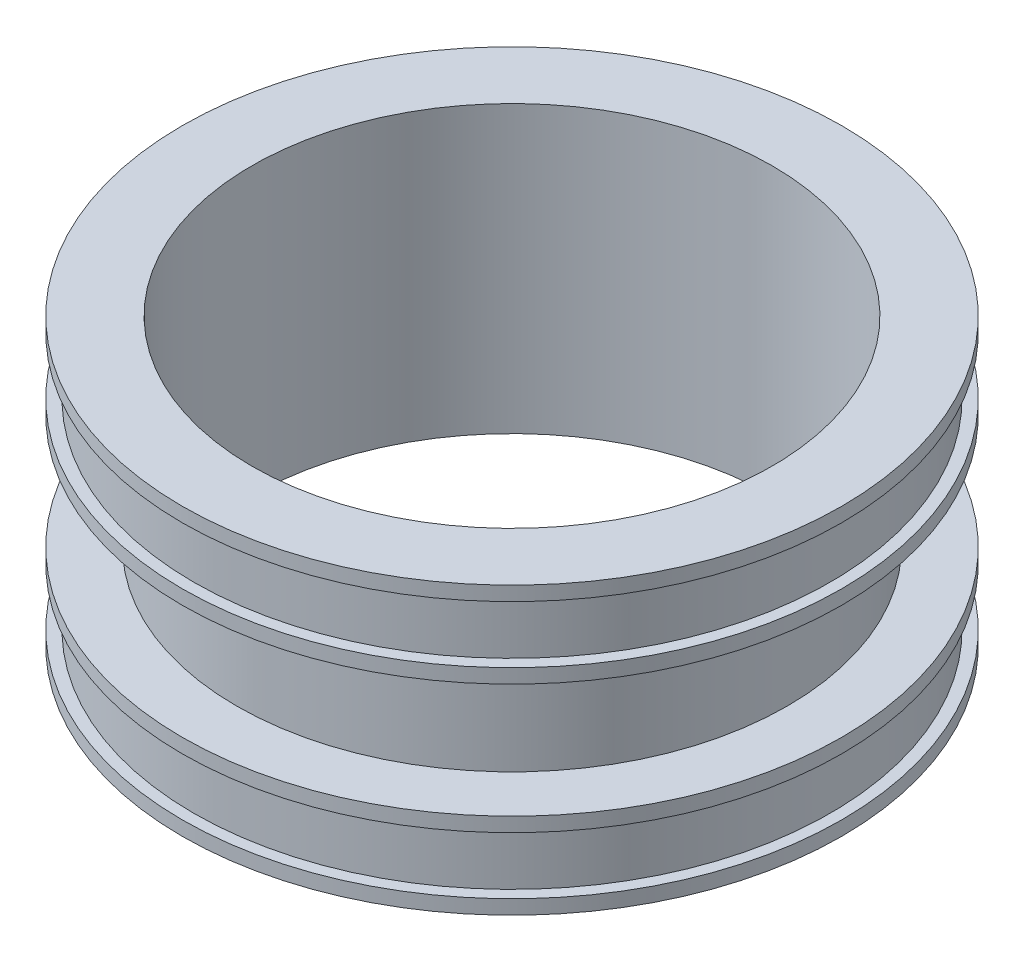
ISO-10303-21;
HEADER;
FILE_DESCRIPTION(('STEP AP214'),'2;1');
FILE_NAME('part.step','',(''),(''),'','','');
FILE_SCHEMA(('AUTOMOTIVE_DESIGN { 1 0 10303 214 1 1 1 1 }'));
ENDSEC;
DATA;
#1=APPLICATION_CONTEXT('core data for automotive mechanical design processes');
#2=APPLICATION_PROTOCOL_DEFINITION('international standard','automotive_design',2000,#1);
#3=PRODUCT_CONTEXT('',#1,'mechanical');
#4=PRODUCT('Part','Part','',(#3));
#5=PRODUCT_RELATED_PRODUCT_CATEGORY('part','',(#4));
#6=PRODUCT_DEFINITION_FORMATION('','',#4);
#7=PRODUCT_DEFINITION_CONTEXT('part definition',#1,'design');
#8=PRODUCT_DEFINITION('design','',#6,#7);
#9=PRODUCT_DEFINITION_SHAPE('','',#8);
#10=(LENGTH_UNIT() NAMED_UNIT(*) SI_UNIT(.MILLI.,.METRE.));
#11=(NAMED_UNIT(*) PLANE_ANGLE_UNIT() SI_UNIT($,.RADIAN.));
#12=(NAMED_UNIT(*) SI_UNIT($,.STERADIAN.) SOLID_ANGLE_UNIT());
#13=UNCERTAINTY_MEASURE_WITH_UNIT(LENGTH_MEASURE(1.E-05),#10,'distance_accuracy_value','');
#14=(GEOMETRIC_REPRESENTATION_CONTEXT(3) GLOBAL_UNCERTAINTY_ASSIGNED_CONTEXT((#13)) GLOBAL_UNIT_ASSIGNED_CONTEXT((#10,
#11,#12)) REPRESENTATION_CONTEXT('',''));
#15=CARTESIAN_POINT('',(0.,0.,0.));
#16=DIRECTION('',(0.,0.,1.));
#17=DIRECTION('',(1.,0.,0.));
#18=AXIS2_PLACEMENT_3D('',#15,#16,#17);
#19=CARTESIAN_POINT('',(0.,0.,0.));
#20=DIRECTION('',(0.,-1.,0.));
#21=DIRECTION('',(0.,0.,-1.));
#22=AXIS2_PLACEMENT_3D('',#19,#20,#21);
#23=CYLINDRICAL_SURFACE('',#22,136.525);
#24=CARTESIAN_POINT('',(0.,0.,0.));
#25=DIRECTION('',(0.,-1.,0.));
#26=DIRECTION('',(0.,0.,-1.));
#27=AXIS2_PLACEMENT_3D('',#24,#25,#26);
#28=CIRCLE('',#27,136.525);
#29=CARTESIAN_POINT('',(0.,0.,-136.525));
#30=VERTEX_POINT('',#29);
#31=EDGE_CURVE('E92',#30,#30,#28,.T.);
#32=ORIENTED_EDGE('',*,*,#31,.T.);
#33=EDGE_LOOP('',(#32));
#34=FACE_BOUND('',#33,.T.);
#35=CARTESIAN_POINT('',(0.,150.,0.));
#36=DIRECTION('',(0.,-1.,0.));
#37=DIRECTION('',(0.,0.,-1.));
#38=AXIS2_PLACEMENT_3D('',#35,#36,#37);
#39=CIRCLE('',#38,136.525);
#40=CARTESIAN_POINT('',(0.,150.,-136.525));
#41=VERTEX_POINT('',#40);
#42=EDGE_CURVE('E12',#41,#41,#39,.T.);
#43=ORIENTED_EDGE('',*,*,#42,.F.);
#44=EDGE_LOOP('',(#43));
#45=FACE_BOUND('',#44,.T.);
#46=ADVANCED_FACE('F40',(#34,#45),#23,.F.);
#47=CARTESIAN_POINT('',(136.525,150.,0.));
#48=DIRECTION('',(0.,1.,0.));
#49=DIRECTION('',(0.,0.,1.));
#50=AXIS2_PLACEMENT_3D('',#47,#48,#49);
#51=PLANE('',#50);
#52=ORIENTED_EDGE('',*,*,#42,.T.);
#53=EDGE_LOOP('',(#52));
#54=FACE_BOUND('',#53,.T.);
#55=CARTESIAN_POINT('',(0.,150.,0.));
#56=DIRECTION('',(0.,-1.,0.));
#57=DIRECTION('',(0.,0.,-1.));
#58=AXIS2_PLACEMENT_3D('',#55,#56,#57);
#59=CIRCLE('',#58,173.);
#60=CARTESIAN_POINT('',(0.,150.,-173.));
#61=VERTEX_POINT('',#60);
#62=EDGE_CURVE('E46',#61,#61,#59,.T.);
#63=ORIENTED_EDGE('',*,*,#62,.F.);
#64=EDGE_LOOP('',(#63));
#65=FACE_BOUND('',#64,.T.);
#66=ADVANCED_FACE('F110',(#54,#65),#51,.T.);
#67=CARTESIAN_POINT('',(0.,0.,0.));
#68=DIRECTION('',(0.,-1.,0.));
#69=DIRECTION('',(0.,0.,-1.));
#70=AXIS2_PLACEMENT_3D('',#67,#68,#69);
#71=CYLINDRICAL_SURFACE('',#70,173.);
#72=ORIENTED_EDGE('',*,*,#62,.T.);
#73=EDGE_LOOP('',(#72));
#74=FACE_BOUND('',#73,.T.);
#75=CARTESIAN_POINT('',(0.,142.5,0.));
#76=DIRECTION('',(0.,-1.,0.));
#77=DIRECTION('',(0.,0.,-1.));
#78=AXIS2_PLACEMENT_3D('',#75,#76,#77);
#79=CIRCLE('',#78,173.);
#80=CARTESIAN_POINT('',(0.,142.5,-173.));
#81=VERTEX_POINT('',#80);
#82=EDGE_CURVE('E50',#81,#81,#79,.T.);
#83=ORIENTED_EDGE('',*,*,#82,.F.);
#84=EDGE_LOOP('',(#83));
#85=FACE_BOUND('',#84,.T.);
#86=ADVANCED_FACE('F114',(#74,#85),#71,.T.);
#87=CARTESIAN_POINT('',(173.,142.5,0.));
#88=DIRECTION('',(0.,-1.,0.));
#89=DIRECTION('',(0.,0.,-1.));
#90=AXIS2_PLACEMENT_3D('',#87,#88,#89);
#91=PLANE('',#90);
#92=ORIENTED_EDGE('',*,*,#82,.T.);
#93=EDGE_LOOP('',(#92));
#94=FACE_BOUND('',#93,.T.);
#95=CARTESIAN_POINT('',(0.,142.5,0.));
#96=DIRECTION('',(0.,-1.,0.));
#97=DIRECTION('',(0.,0.,-1.));
#98=AXIS2_PLACEMENT_3D('',#95,#96,#97);
#99=CIRCLE('',#98,167.);
#100=CARTESIAN_POINT('',(0.,142.5,-167.));
#101=VERTEX_POINT('',#100);
#102=EDGE_CURVE('E54',#101,#101,#99,.T.);
#103=ORIENTED_EDGE('',*,*,#102,.F.);
#104=EDGE_LOOP('',(#103));
#105=FACE_BOUND('',#104,.T.);
#106=ADVANCED_FACE('F118',(#94,#105),#91,.T.);
#107=CARTESIAN_POINT('',(0.,0.,0.));
#108=DIRECTION('',(0.,-1.,0.));
#109=DIRECTION('',(0.,0.,-1.));
#110=AXIS2_PLACEMENT_3D('',#107,#108,#109);
#111=CYLINDRICAL_SURFACE('',#110,167.);
#112=ORIENTED_EDGE('',*,*,#102,.T.);
#113=EDGE_LOOP('',(#112));
#114=FACE_BOUND('',#113,.T.);
#115=CARTESIAN_POINT('',(0.,112.5,0.));
#116=DIRECTION('',(0.,-1.,0.));
#117=DIRECTION('',(0.,0.,-1.));
#118=AXIS2_PLACEMENT_3D('',#115,#116,#117);
#119=CIRCLE('',#118,167.);
#120=CARTESIAN_POINT('',(0.,112.5,-167.));
#121=VERTEX_POINT('',#120);
#122=EDGE_CURVE('E59',#121,#121,#119,.T.);
#123=ORIENTED_EDGE('',*,*,#122,.F.);
#124=EDGE_LOOP('',(#123));
#125=FACE_BOUND('',#124,.T.);
#126=ADVANCED_FACE('F124',(#114,#125),#111,.T.);
#127=CARTESIAN_POINT('',(167.,112.5,0.));
#128=DIRECTION('',(0.,1.,0.));
#129=DIRECTION('',(0.,0.,1.));
#130=AXIS2_PLACEMENT_3D('',#127,#128,#129);
#131=PLANE('',#130);
#132=ORIENTED_EDGE('',*,*,#122,.T.);
#133=EDGE_LOOP('',(#132));
#134=FACE_BOUND('',#133,.T.);
#135=CARTESIAN_POINT('',(0.,112.5,0.));
#136=DIRECTION('',(0.,-1.,0.));
#137=DIRECTION('',(0.,0.,-1.));
#138=AXIS2_PLACEMENT_3D('',#135,#136,#137);
#139=CIRCLE('',#138,173.);
#140=CARTESIAN_POINT('',(0.,112.5,-173.));
#141=VERTEX_POINT('',#140);
#142=EDGE_CURVE('E62',#141,#141,#139,.T.);
#143=ORIENTED_EDGE('',*,*,#142,.F.);
#144=EDGE_LOOP('',(#143));
#145=FACE_BOUND('',#144,.T.);
#146=ADVANCED_FACE('F128',(#134,#145),#131,.T.);
#147=CARTESIAN_POINT('',(0.,0.,0.));
#148=DIRECTION('',(0.,-1.,0.));
#149=DIRECTION('',(0.,0.,-1.));
#150=AXIS2_PLACEMENT_3D('',#147,#148,#149);
#151=CYLINDRICAL_SURFACE('',#150,173.);
#152=ORIENTED_EDGE('',*,*,#142,.T.);
#153=EDGE_LOOP('',(#152));
#154=FACE_BOUND('',#153,.T.);
#155=CARTESIAN_POINT('',(0.,105.,0.));
#156=DIRECTION('',(0.,-1.,0.));
#157=DIRECTION('',(0.,0.,-1.));
#158=AXIS2_PLACEMENT_3D('',#155,#156,#157);
#159=CIRCLE('',#158,173.);
#160=CARTESIAN_POINT('',(0.,105.,-173.));
#161=VERTEX_POINT('',#160);
#162=EDGE_CURVE('E65',#161,#161,#159,.T.);
#163=ORIENTED_EDGE('',*,*,#162,.F.);
#164=EDGE_LOOP('',(#163));
#165=FACE_BOUND('',#164,.T.);
#166=ADVANCED_FACE('F132',(#154,#165),#151,.T.);
#167=CARTESIAN_POINT('',(173.,105.,0.));
#168=DIRECTION('',(0.,-1.,0.));
#169=DIRECTION('',(0.,0.,-1.));
#170=AXIS2_PLACEMENT_3D('',#167,#168,#169);
#171=PLANE('',#170);
#172=ORIENTED_EDGE('',*,*,#162,.T.);
#173=EDGE_LOOP('',(#172));
#174=FACE_BOUND('',#173,.T.);
#175=CARTESIAN_POINT('',(0.,105.,0.));
#176=DIRECTION('',(0.,-1.,0.));
#177=DIRECTION('',(0.,0.,-1.));
#178=AXIS2_PLACEMENT_3D('',#175,#176,#177);
#179=CIRCLE('',#178,144.525);
#180=CARTESIAN_POINT('',(0.,105.,-144.525));
#181=VERTEX_POINT('',#180);
#182=EDGE_CURVE('E68',#181,#181,#179,.T.);
#183=ORIENTED_EDGE('',*,*,#182,.F.);
#184=EDGE_LOOP('',(#183));
#185=FACE_BOUND('',#184,.T.);
#186=ADVANCED_FACE('F136',(#174,#185),#171,.T.);
#187=CARTESIAN_POINT('',(0.,0.,0.));
#188=DIRECTION('',(0.,-1.,0.));
#189=DIRECTION('',(0.,0.,-1.));
#190=AXIS2_PLACEMENT_3D('',#187,#188,#189);
#191=CYLINDRICAL_SURFACE('',#190,144.525);
#192=ORIENTED_EDGE('',*,*,#182,.T.);
#193=EDGE_LOOP('',(#192));
#194=FACE_BOUND('',#193,.T.);
#195=CARTESIAN_POINT('',(0.,44.9999999999999,0.));
#196=DIRECTION('',(0.,-1.,0.));
#197=DIRECTION('',(0.,0.,-1.));
#198=AXIS2_PLACEMENT_3D('',#195,#196,#197);
#199=CIRCLE('',#198,144.525);
#200=CARTESIAN_POINT('',(0.,44.9999999999999,-144.525));
#201=VERTEX_POINT('',#200);
#202=EDGE_CURVE('E71',#201,#201,#199,.T.);
#203=ORIENTED_EDGE('',*,*,#202,.F.);
#204=EDGE_LOOP('',(#203));
#205=FACE_BOUND('',#204,.T.);
#206=ADVANCED_FACE('F140',(#194,#205),#191,.T.);
#207=CARTESIAN_POINT('',(144.525,44.9999999999999,0.));
#208=DIRECTION('',(0.,1.,0.));
#209=DIRECTION('',(0.,0.,1.));
#210=AXIS2_PLACEMENT_3D('',#207,#208,#209);
#211=PLANE('',#210);
#212=ORIENTED_EDGE('',*,*,#202,.T.);
#213=EDGE_LOOP('',(#212));
#214=FACE_BOUND('',#213,.T.);
#215=CARTESIAN_POINT('',(0.,44.9999999999999,0.));
#216=DIRECTION('',(0.,-1.,0.));
#217=DIRECTION('',(0.,0.,-1.));
#218=AXIS2_PLACEMENT_3D('',#215,#216,#217);
#219=CIRCLE('',#218,173.);
#220=CARTESIAN_POINT('',(0.,44.9999999999999,-173.));
#221=VERTEX_POINT('',#220);
#222=EDGE_CURVE('E74',#221,#221,#219,.T.);
#223=ORIENTED_EDGE('',*,*,#222,.F.);
#224=EDGE_LOOP('',(#223));
#225=FACE_BOUND('',#224,.T.);
#226=ADVANCED_FACE('F144',(#214,#225),#211,.T.);
#227=CARTESIAN_POINT('',(0.,0.,0.));
#228=DIRECTION('',(0.,-1.,0.));
#229=DIRECTION('',(0.,0.,-1.));
#230=AXIS2_PLACEMENT_3D('',#227,#228,#229);
#231=CYLINDRICAL_SURFACE('',#230,173.);
#232=ORIENTED_EDGE('',*,*,#222,.T.);
#233=EDGE_LOOP('',(#232));
#234=FACE_BOUND('',#233,.T.);
#235=CARTESIAN_POINT('',(0.,37.5000000000001,0.));
#236=DIRECTION('',(0.,-1.,0.));
#237=DIRECTION('',(0.,0.,-1.));
#238=AXIS2_PLACEMENT_3D('',#235,#236,#237);
#239=CIRCLE('',#238,173.);
#240=CARTESIAN_POINT('',(0.,37.5000000000001,-173.));
#241=VERTEX_POINT('',#240);
#242=EDGE_CURVE('E77',#241,#241,#239,.T.);
#243=ORIENTED_EDGE('',*,*,#242,.F.);
#244=EDGE_LOOP('',(#243));
#245=FACE_BOUND('',#244,.T.);
#246=ADVANCED_FACE('F148',(#234,#245),#231,.T.);
#247=CARTESIAN_POINT('',(167.,37.5000000000001,0.));
#248=DIRECTION('',(0.,-1.,0.));
#249=DIRECTION('',(0.,0.,-1.));
#250=AXIS2_PLACEMENT_3D('',#247,#248,#249);
#251=PLANE('',#250);
#252=ORIENTED_EDGE('',*,*,#242,.T.);
#253=EDGE_LOOP('',(#252));
#254=FACE_BOUND('',#253,.T.);
#255=CARTESIAN_POINT('',(0.,37.5000000000001,0.));
#256=DIRECTION('',(0.,-1.,0.));
#257=DIRECTION('',(0.,0.,-1.));
#258=AXIS2_PLACEMENT_3D('',#255,#256,#257);
#259=CIRCLE('',#258,167.);
#260=CARTESIAN_POINT('',(0.,37.5000000000001,-167.));
#261=VERTEX_POINT('',#260);
#262=EDGE_CURVE('E80',#261,#261,#259,.T.);
#263=ORIENTED_EDGE('',*,*,#262,.F.);
#264=EDGE_LOOP('',(#263));
#265=FACE_BOUND('',#264,.T.);
#266=ADVANCED_FACE('F152',(#254,#265),#251,.T.);
#267=CARTESIAN_POINT('',(0.,0.,0.));
#268=DIRECTION('',(0.,-1.,0.));
#269=DIRECTION('',(0.,0.,-1.));
#270=AXIS2_PLACEMENT_3D('',#267,#268,#269);
#271=CYLINDRICAL_SURFACE('',#270,167.);
#272=ORIENTED_EDGE('',*,*,#262,.T.);
#273=EDGE_LOOP('',(#272));
#274=FACE_BOUND('',#273,.T.);
#275=CARTESIAN_POINT('',(0.,7.50000000000006,0.));
#276=DIRECTION('',(0.,-1.,0.));
#277=DIRECTION('',(0.,0.,-1.));
#278=AXIS2_PLACEMENT_3D('',#275,#276,#277);
#279=CIRCLE('',#278,167.);
#280=CARTESIAN_POINT('',(0.,7.50000000000006,-167.));
#281=VERTEX_POINT('',#280);
#282=EDGE_CURVE('E83',#281,#281,#279,.T.);
#283=ORIENTED_EDGE('',*,*,#282,.F.);
#284=EDGE_LOOP('',(#283));
#285=FACE_BOUND('',#284,.T.);
#286=ADVANCED_FACE('F156',(#274,#285),#271,.T.);
#287=CARTESIAN_POINT('',(173.,7.50000000000006,0.));
#288=DIRECTION('',(0.,1.,0.));
#289=DIRECTION('',(0.,0.,1.));
#290=AXIS2_PLACEMENT_3D('',#287,#288,#289);
#291=PLANE('',#290);
#292=ORIENTED_EDGE('',*,*,#282,.T.);
#293=EDGE_LOOP('',(#292));
#294=FACE_BOUND('',#293,.T.);
#295=CARTESIAN_POINT('',(0.,7.50000000000006,0.));
#296=DIRECTION('',(0.,-1.,0.));
#297=DIRECTION('',(0.,0.,-1.));
#298=AXIS2_PLACEMENT_3D('',#295,#296,#297);
#299=CIRCLE('',#298,173.);
#300=CARTESIAN_POINT('',(0.,7.50000000000006,-173.));
#301=VERTEX_POINT('',#300);
#302=EDGE_CURVE('E86',#301,#301,#299,.T.);
#303=ORIENTED_EDGE('',*,*,#302,.F.);
#304=EDGE_LOOP('',(#303));
#305=FACE_BOUND('',#304,.T.);
#306=ADVANCED_FACE('F106',(#294,#305),#291,.T.);
#307=CARTESIAN_POINT('',(0.,0.,0.));
#308=DIRECTION('',(0.,-1.,0.));
#309=DIRECTION('',(0.,0.,-1.));
#310=AXIS2_PLACEMENT_3D('',#307,#308,#309);
#311=CYLINDRICAL_SURFACE('',#310,173.);
#312=ORIENTED_EDGE('',*,*,#302,.T.);
#313=EDGE_LOOP('',(#312));
#314=FACE_BOUND('',#313,.T.);
#315=CARTESIAN_POINT('',(0.,0.,0.));
#316=DIRECTION('',(0.,-1.,0.));
#317=DIRECTION('',(0.,0.,-1.));
#318=AXIS2_PLACEMENT_3D('',#315,#316,#317);
#319=CIRCLE('',#318,173.);
#320=CARTESIAN_POINT('',(0.,0.,-173.));
#321=VERTEX_POINT('',#320);
#322=EDGE_CURVE('E89',#321,#321,#319,.T.);
#323=ORIENTED_EDGE('',*,*,#322,.F.);
#324=EDGE_LOOP('',(#323));
#325=FACE_BOUND('',#324,.T.);
#326=ADVANCED_FACE('F100',(#314,#325),#311,.T.);
#327=CARTESIAN_POINT('',(173.,0.,0.));
#328=DIRECTION('',(0.,-1.,0.));
#329=DIRECTION('',(0.,0.,-1.));
#330=AXIS2_PLACEMENT_3D('',#327,#328,#329);
#331=PLANE('',#330);
#332=ORIENTED_EDGE('',*,*,#322,.T.);
#333=EDGE_LOOP('',(#332));
#334=FACE_BOUND('',#333,.T.);
#335=ORIENTED_EDGE('',*,*,#31,.F.);
#336=EDGE_LOOP('',(#335));
#337=FACE_BOUND('',#336,.T.);
#338=ADVANCED_FACE('F98',(#334,#337),#331,.T.);
#339=CLOSED_SHELL('',(#46,#66,#86,#106,#126,#146,#166,#186,#206,#226,#246,#266,#286,#306,#326,#338));
#340=MANIFOLD_SOLID_BREP('B2',#339);
#341=ADVANCED_BREP_SHAPE_REPRESENTATION('',(#18,#340),#14);
#342=SHAPE_DEFINITION_REPRESENTATION(#9,#341);
ENDSEC;
END-ISO-10303-21;
